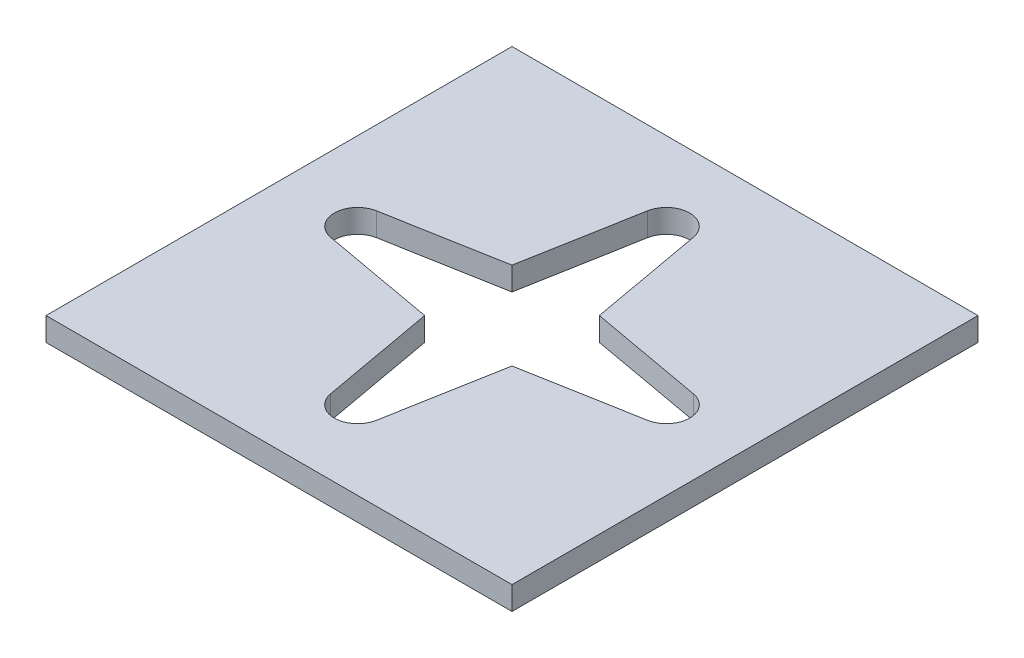
ISO-10303-21;
HEADER;
FILE_DESCRIPTION(('STEP AP214'),'2;1');
FILE_NAME('part.step','',(''),(''),'','','');
FILE_SCHEMA(('AUTOMOTIVE_DESIGN { 1 0 10303 214 1 1 1 1 }'));
ENDSEC;
DATA;
#1=APPLICATION_CONTEXT('core data for automotive mechanical design processes');
#2=APPLICATION_PROTOCOL_DEFINITION('international standard','automotive_design',2000,#1);
#3=PRODUCT_CONTEXT('',#1,'mechanical');
#4=PRODUCT('Part','Part','',(#3));
#5=PRODUCT_RELATED_PRODUCT_CATEGORY('part','',(#4));
#6=PRODUCT_DEFINITION_FORMATION('','',#4);
#7=PRODUCT_DEFINITION_CONTEXT('part definition',#1,'design');
#8=PRODUCT_DEFINITION('design','',#6,#7);
#9=PRODUCT_DEFINITION_SHAPE('','',#8);
#10=(LENGTH_UNIT() NAMED_UNIT(*) SI_UNIT(.MILLI.,.METRE.));
#11=(NAMED_UNIT(*) PLANE_ANGLE_UNIT() SI_UNIT($,.RADIAN.));
#12=(NAMED_UNIT(*) SI_UNIT($,.STERADIAN.) SOLID_ANGLE_UNIT());
#13=UNCERTAINTY_MEASURE_WITH_UNIT(LENGTH_MEASURE(1.E-05),#10,'distance_accuracy_value','');
#14=(GEOMETRIC_REPRESENTATION_CONTEXT(3) GLOBAL_UNCERTAINTY_ASSIGNED_CONTEXT((#13)) GLOBAL_UNIT_ASSIGNED_CONTEXT((#10,
#11,#12)) REPRESENTATION_CONTEXT('',''));
#15=CARTESIAN_POINT('',(0.,0.,0.));
#16=DIRECTION('',(0.,0.,1.));
#17=DIRECTION('',(1.,0.,0.));
#18=AXIS2_PLACEMENT_3D('',#15,#16,#17);
#19=CARTESIAN_POINT('',(25.4,2.54,-25.4));
#20=DIRECTION('',(-1.,0.,0.));
#21=DIRECTION('',(0.,0.,1.));
#22=AXIS2_PLACEMENT_3D('',#19,#20,#21);
#23=PLANE('',#22);
#24=DIRECTION('',(0.,0.,-1.));
#25=VECTOR('',#24,1.);
#26=CARTESIAN_POINT('',(25.4,0.,-25.4));
#27=LINE('',#26,#25);
#28=CARTESIAN_POINT('',(25.4,0.,25.4));
#29=VERTEX_POINT('',#28);
#30=CARTESIAN_POINT('',(25.4,0.,-25.4));
#31=VERTEX_POINT('',#30);
#32=EDGE_CURVE('E219',#29,#31,#27,.T.);
#33=ORIENTED_EDGE('',*,*,#32,.T.);
#34=DIRECTION('',(0.,-1.,0.));
#35=VECTOR('',#34,1.);
#36=CARTESIAN_POINT('',(25.4,2.54,-25.4));
#37=LINE('',#36,#35);
#38=CARTESIAN_POINT('',(25.4,2.54,-25.4));
#39=VERTEX_POINT('',#38);
#40=EDGE_CURVE('E11',#39,#31,#37,.T.);
#41=ORIENTED_EDGE('',*,*,#40,.F.);
#42=DIRECTION('',(0.,0.,-1.));
#43=VECTOR('',#42,1.);
#44=CARTESIAN_POINT('',(25.4,2.54,-25.4));
#45=LINE('',#44,#43);
#46=CARTESIAN_POINT('',(25.4,2.54,25.4));
#47=VERTEX_POINT('',#46);
#48=EDGE_CURVE('E239',#47,#39,#45,.T.);
#49=ORIENTED_EDGE('',*,*,#48,.F.);
#50=DIRECTION('',(0.,-1.,0.));
#51=VECTOR('',#50,1.);
#52=CARTESIAN_POINT('',(25.4,2.54,25.4));
#53=LINE('',#52,#51);
#54=EDGE_CURVE('E249',#47,#29,#53,.T.);
#55=ORIENTED_EDGE('',*,*,#54,.T.);
#56=EDGE_LOOP('',(#33,#41,#49,#55));
#57=FACE_BOUND('',#56,.T.);
#58=ADVANCED_FACE('F32',(#57),#23,.F.);
#59=CARTESIAN_POINT('',(-25.4,2.54,-25.4));
#60=DIRECTION('',(0.,0.,1.));
#61=DIRECTION('',(1.,0.,0.));
#62=AXIS2_PLACEMENT_3D('',#59,#60,#61);
#63=PLANE('',#62);
#64=DIRECTION('',(-1.,0.,0.));
#65=VECTOR('',#64,1.);
#66=CARTESIAN_POINT('',(-25.4,0.,-25.4));
#67=LINE('',#66,#65);
#68=CARTESIAN_POINT('',(-25.4,0.,-25.4));
#69=VERTEX_POINT('',#68);
#70=EDGE_CURVE('E252',#31,#69,#67,.T.);
#71=ORIENTED_EDGE('',*,*,#70,.T.);
#72=DIRECTION('',(0.,-1.,0.));
#73=VECTOR('',#72,1.);
#74=CARTESIAN_POINT('',(-25.4,2.54,-25.4));
#75=LINE('',#74,#73);
#76=CARTESIAN_POINT('',(-25.4,2.54,-25.4));
#77=VERTEX_POINT('',#76);
#78=EDGE_CURVE('E39',#77,#69,#75,.T.);
#79=ORIENTED_EDGE('',*,*,#78,.F.);
#80=DIRECTION('',(-1.,0.,0.));
#81=VECTOR('',#80,1.);
#82=CARTESIAN_POINT('',(-25.4,2.54,-25.4));
#83=LINE('',#82,#81);
#84=EDGE_CURVE('E242',#39,#77,#83,.T.);
#85=ORIENTED_EDGE('',*,*,#84,.F.);
#86=ORIENTED_EDGE('',*,*,#40,.T.);
#87=EDGE_LOOP('',(#71,#79,#85,#86));
#88=FACE_BOUND('',#87,.T.);
#89=ADVANCED_FACE('F280',(#88),#63,.F.);
#90=CARTESIAN_POINT('',(-25.4,2.54,-25.4));
#91=DIRECTION('',(1.,0.,0.));
#92=DIRECTION('',(0.,0.,-1.));
#93=AXIS2_PLACEMENT_3D('',#90,#91,#92);
#94=PLANE('',#93);
#95=DIRECTION('',(0.,0.,1.));
#96=VECTOR('',#95,1.);
#97=CARTESIAN_POINT('',(-25.4,0.,-25.4));
#98=LINE('',#97,#96);
#99=CARTESIAN_POINT('',(-25.4,0.,25.4));
#100=VERTEX_POINT('',#99);
#101=EDGE_CURVE('E254',#69,#100,#98,.T.);
#102=ORIENTED_EDGE('',*,*,#101,.T.);
#103=DIRECTION('',(0.,-1.,0.));
#104=VECTOR('',#103,1.);
#105=CARTESIAN_POINT('',(-25.4,2.54,25.4));
#106=LINE('',#105,#104);
#107=CARTESIAN_POINT('',(-25.4,2.54,25.4));
#108=VERTEX_POINT('',#107);
#109=EDGE_CURVE('E259',#108,#100,#106,.T.);
#110=ORIENTED_EDGE('',*,*,#109,.F.);
#111=DIRECTION('',(0.,0.,1.));
#112=VECTOR('',#111,1.);
#113=CARTESIAN_POINT('',(-25.4,2.54,-25.4));
#114=LINE('',#113,#112);
#115=EDGE_CURVE('E245',#77,#108,#114,.T.);
#116=ORIENTED_EDGE('',*,*,#115,.F.);
#117=ORIENTED_EDGE('',*,*,#78,.T.);
#118=EDGE_LOOP('',(#102,#110,#116,#117));
#119=FACE_BOUND('',#118,.T.);
#120=ADVANCED_FACE('F266',(#119),#94,.F.);
#121=CARTESIAN_POINT('',(-25.4,2.54,25.4));
#122=DIRECTION('',(0.,0.,-1.));
#123=DIRECTION('',(-1.,0.,0.));
#124=AXIS2_PLACEMENT_3D('',#121,#122,#123);
#125=PLANE('',#124);
#126=DIRECTION('',(1.,0.,0.));
#127=VECTOR('',#126,1.);
#128=CARTESIAN_POINT('',(-25.4,0.,25.4));
#129=LINE('',#128,#127);
#130=EDGE_CURVE('E243',#100,#29,#129,.T.);
#131=ORIENTED_EDGE('',*,*,#130,.T.);
#132=ORIENTED_EDGE('',*,*,#54,.F.);
#133=DIRECTION('',(1.,0.,0.));
#134=VECTOR('',#133,1.);
#135=CARTESIAN_POINT('',(-25.4,2.54,25.4));
#136=LINE('',#135,#134);
#137=EDGE_CURVE('E247',#108,#47,#136,.T.);
#138=ORIENTED_EDGE('',*,*,#137,.F.);
#139=ORIENTED_EDGE('',*,*,#109,.T.);
#140=EDGE_LOOP('',(#131,#132,#138,#139));
#141=FACE_BOUND('',#140,.T.);
#142=ADVANCED_FACE('F275',(#141),#125,.F.);
#143=CARTESIAN_POINT('',(0.,2.54,0.));
#144=DIRECTION('',(0.,1.,0.));
#145=DIRECTION('',(0.,0.,1.));
#146=AXIS2_PLACEMENT_3D('',#143,#144,#145);
#147=PLANE('',#146);
#148=DIRECTION('',(-0.98409435617326,0.,-0.177646553999611));
#149=VECTOR('',#148,1.);
#150=CARTESIAN_POINT('',(-4.75953574416668,2.54,4.75953574416663));
#151=LINE('',#150,#149);
#152=CARTESIAN_POINT('',(-4.75953574416668,2.54,4.75953574416663));
#153=VERTEX_POINT('',#152);
#154=CARTESIAN_POINT('',(-17.278722247159,2.54,2.49959966468008));
#155=VERTEX_POINT('',#154);
#156=EDGE_CURVE('E146',#153,#155,#151,.T.);
#157=ORIENTED_EDGE('',*,*,#156,.T.);
#158=CARTESIAN_POINT('',(-16.8275,2.54,0.));
#159=DIRECTION('',(0.,-1.,0.));
#160=DIRECTION('',(0.,0.,-1.));
#161=AXIS2_PLACEMENT_3D('',#158,#159,#160);
#162=CIRCLE('',#161,2.54);
#163=CARTESIAN_POINT('',(-17.278722247159,2.54,-2.49959966468008));
#164=VERTEX_POINT('',#163);
#165=EDGE_CURVE('E152',#155,#164,#162,.T.);
#166=ORIENTED_EDGE('',*,*,#165,.T.);
#167=DIRECTION('',(-0.98409435617326,0.,0.177646553999611));
#168=VECTOR('',#167,1.);
#169=CARTESIAN_POINT('',(-4.75953574416668,2.54,-4.75953574416663));
#170=LINE('',#169,#168);
#171=CARTESIAN_POINT('',(-4.75953574416668,2.54,-4.75953574416663));
#172=VERTEX_POINT('',#171);
#173=EDGE_CURVE('E156',#172,#164,#170,.T.);
#174=ORIENTED_EDGE('',*,*,#173,.F.);
#175=DIRECTION('',(0.177646553999614,0.,-0.98409435617326));
#176=VECTOR('',#175,1.);
#177=CARTESIAN_POINT('',(-4.75953574416668,2.54,-4.75953574416663));
#178=LINE('',#177,#176);
#179=CARTESIAN_POINT('',(-2.49959966468009,2.54,-17.278722247159));
#180=VERTEX_POINT('',#179);
#181=EDGE_CURVE('E168',#172,#180,#178,.T.);
#182=ORIENTED_EDGE('',*,*,#181,.T.);
#183=CARTESIAN_POINT('',(0.,2.54,-16.8275));
#184=DIRECTION('',(0.,1.,0.));
#185=DIRECTION('',(0.,0.,1.));
#186=AXIS2_PLACEMENT_3D('',#183,#184,#185);
#187=CIRCLE('',#186,2.54);
#188=CARTESIAN_POINT('',(2.49959966468008,2.54,-17.278722247159));
#189=VERTEX_POINT('',#188);
#190=EDGE_CURVE('E171',#189,#180,#187,.T.);
#191=ORIENTED_EDGE('',*,*,#190,.F.);
#192=DIRECTION('',(-0.177646553999614,0.,-0.98409435617326));
#193=VECTOR('',#192,1.);
#194=CARTESIAN_POINT('',(4.75953574416668,2.54,-4.75953574416664));
#195=LINE('',#194,#193);
#196=CARTESIAN_POINT('',(4.75953574416668,2.54,-4.75953574416664));
#197=VERTEX_POINT('',#196);
#198=EDGE_CURVE('E173',#197,#189,#195,.T.);
#199=ORIENTED_EDGE('',*,*,#198,.F.);
#200=DIRECTION('',(0.98409435617326,0.,0.177646553999611));
#201=VECTOR('',#200,1.);
#202=CARTESIAN_POINT('',(4.75953574416668,2.54,-4.75953574416664));
#203=LINE('',#202,#201);
#204=CARTESIAN_POINT('',(17.278722247159,2.54,-2.49959966468008));
#205=VERTEX_POINT('',#204);
#206=EDGE_CURVE('E175',#197,#205,#203,.T.);
#207=ORIENTED_EDGE('',*,*,#206,.T.);
#208=CARTESIAN_POINT('',(16.8275,2.54,0.));
#209=DIRECTION('',(0.,1.,0.));
#210=DIRECTION('',(0.,0.,1.));
#211=AXIS2_PLACEMENT_3D('',#208,#209,#210);
#212=CIRCLE('',#211,2.54000000000001);
#213=CARTESIAN_POINT('',(17.278722247159,2.54,2.49959966468009));
#214=VERTEX_POINT('',#213);
#215=EDGE_CURVE('E178',#214,#205,#212,.T.);
#216=ORIENTED_EDGE('',*,*,#215,.F.);
#217=DIRECTION('',(0.98409435617326,0.,-0.177646553999611));
#218=VECTOR('',#217,1.);
#219=CARTESIAN_POINT('',(4.75953574416668,2.54,4.75953574416664));
#220=LINE('',#219,#218);
#221=CARTESIAN_POINT('',(4.75953574416668,2.54,4.75953574416664));
#222=VERTEX_POINT('',#221);
#223=EDGE_CURVE('E180',#222,#214,#220,.T.);
#224=ORIENTED_EDGE('',*,*,#223,.F.);
#225=DIRECTION('',(-0.177646553999614,0.,0.98409435617326));
#226=VECTOR('',#225,1.);
#227=CARTESIAN_POINT('',(4.75953574416668,2.54,4.75953574416664));
#228=LINE('',#227,#226);
#229=CARTESIAN_POINT('',(2.49959966468008,2.54,17.278722247159));
#230=VERTEX_POINT('',#229);
#231=EDGE_CURVE('E182',#222,#230,#228,.T.);
#232=ORIENTED_EDGE('',*,*,#231,.T.);
#233=CARTESIAN_POINT('',(0.,2.54,16.8275));
#234=DIRECTION('',(0.,-1.,0.));
#235=DIRECTION('',(0.,0.,-1.));
#236=AXIS2_PLACEMENT_3D('',#233,#234,#235);
#237=CIRCLE('',#236,2.54000000000001);
#238=CARTESIAN_POINT('',(-2.49959966468009,2.54,17.278722247159));
#239=VERTEX_POINT('',#238);
#240=EDGE_CURVE('E185',#230,#239,#237,.T.);
#241=ORIENTED_EDGE('',*,*,#240,.T.);
#242=DIRECTION('',(0.177646553999614,0.,0.98409435617326));
#243=VECTOR('',#242,1.);
#244=CARTESIAN_POINT('',(-4.75953574416668,2.54,4.75953574416663));
#245=LINE('',#244,#243);
#246=EDGE_CURVE('E149',#153,#239,#245,.T.);
#247=ORIENTED_EDGE('',*,*,#246,.F.);
#248=EDGE_LOOP('',(#157,#166,#174,#182,#191,#199,#207,#216,#224,#232,#241,#247));
#249=FACE_BOUND('',#248,.T.);
#250=ORIENTED_EDGE('',*,*,#48,.T.);
#251=ORIENTED_EDGE('',*,*,#84,.T.);
#252=ORIENTED_EDGE('',*,*,#115,.T.);
#253=ORIENTED_EDGE('',*,*,#137,.T.);
#254=EDGE_LOOP('',(#250,#251,#252,#253));
#255=FACE_BOUND('',#254,.T.);
#256=ADVANCED_FACE('F158',(#249,#255),#147,.T.);
#257=CARTESIAN_POINT('',(0.,0.,0.));
#258=DIRECTION('',(0.,1.,0.));
#259=DIRECTION('',(0.,0.,1.));
#260=AXIS2_PLACEMENT_3D('',#257,#258,#259);
#261=PLANE('',#260);
#262=CARTESIAN_POINT('',(-16.8275,0.,0.));
#263=DIRECTION('',(0.,-1.,0.));
#264=DIRECTION('',(0.,0.,-1.));
#265=AXIS2_PLACEMENT_3D('',#262,#263,#264);
#266=CIRCLE('',#265,2.54);
#267=CARTESIAN_POINT('',(-17.278722247159,0.,2.49959966468008));
#268=VERTEX_POINT('',#267);
#269=CARTESIAN_POINT('',(-17.278722247159,0.,-2.49959966468008));
#270=VERTEX_POINT('',#269);
#271=EDGE_CURVE('E189',#268,#270,#266,.T.);
#272=ORIENTED_EDGE('',*,*,#271,.F.);
#273=DIRECTION('',(-0.98409435617326,0.,-0.177646553999611));
#274=VECTOR('',#273,1.);
#275=CARTESIAN_POINT('',(-4.75953574416668,0.,4.75953574416663));
#276=LINE('',#275,#274);
#277=CARTESIAN_POINT('',(-4.75953574416668,0.,4.75953574416663));
#278=VERTEX_POINT('',#277);
#279=EDGE_CURVE('E54',#278,#268,#276,.T.);
#280=ORIENTED_EDGE('',*,*,#279,.F.);
#281=DIRECTION('',(0.177646553999614,0.,0.98409435617326));
#282=VECTOR('',#281,1.);
#283=CARTESIAN_POINT('',(-4.75953574416668,0.,4.75953574416663));
#284=LINE('',#283,#282);
#285=CARTESIAN_POINT('',(-2.49959966468009,0.,17.278722247159));
#286=VERTEX_POINT('',#285);
#287=EDGE_CURVE('E161',#278,#286,#284,.T.);
#288=ORIENTED_EDGE('',*,*,#287,.T.);
#289=CARTESIAN_POINT('',(0.,0.,16.8275));
#290=DIRECTION('',(0.,-1.,0.));
#291=DIRECTION('',(0.,0.,-1.));
#292=AXIS2_PLACEMENT_3D('',#289,#290,#291);
#293=CIRCLE('',#292,2.54000000000001);
#294=CARTESIAN_POINT('',(2.49959966468008,0.,17.278722247159));
#295=VERTEX_POINT('',#294);
#296=EDGE_CURVE('E164',#295,#286,#293,.T.);
#297=ORIENTED_EDGE('',*,*,#296,.F.);
#298=DIRECTION('',(-0.177646553999614,0.,0.98409435617326));
#299=VECTOR('',#298,1.);
#300=CARTESIAN_POINT('',(4.75953574416668,0.,4.75953574416664));
#301=LINE('',#300,#299);
#302=CARTESIAN_POINT('',(4.75953574416668,0.,4.75953574416664));
#303=VERTEX_POINT('',#302);
#304=EDGE_CURVE('E212',#303,#295,#301,.T.);
#305=ORIENTED_EDGE('',*,*,#304,.F.);
#306=DIRECTION('',(0.98409435617326,0.,-0.177646553999611));
#307=VECTOR('',#306,1.);
#308=CARTESIAN_POINT('',(4.75953574416668,0.,4.75953574416664));
#309=LINE('',#308,#307);
#310=CARTESIAN_POINT('',(17.278722247159,0.,2.49959966468009));
#311=VERTEX_POINT('',#310);
#312=EDGE_CURVE('E209',#303,#311,#309,.T.);
#313=ORIENTED_EDGE('',*,*,#312,.T.);
#314=CARTESIAN_POINT('',(16.8275,0.,0.));
#315=DIRECTION('',(0.,1.,0.));
#316=DIRECTION('',(0.,0.,1.));
#317=AXIS2_PLACEMENT_3D('',#314,#315,#316);
#318=CIRCLE('',#317,2.54000000000001);
#319=CARTESIAN_POINT('',(17.278722247159,0.,-2.49959966468008));
#320=VERTEX_POINT('',#319);
#321=EDGE_CURVE('E206',#311,#320,#318,.T.);
#322=ORIENTED_EDGE('',*,*,#321,.T.);
#323=DIRECTION('',(0.98409435617326,0.,0.177646553999611));
#324=VECTOR('',#323,1.);
#325=CARTESIAN_POINT('',(4.75953574416668,0.,-4.75953574416664));
#326=LINE('',#325,#324);
#327=CARTESIAN_POINT('',(4.75953574416668,0.,-4.75953574416664));
#328=VERTEX_POINT('',#327);
#329=EDGE_CURVE('E203',#328,#320,#326,.T.);
#330=ORIENTED_EDGE('',*,*,#329,.F.);
#331=DIRECTION('',(-0.177646553999614,0.,-0.98409435617326));
#332=VECTOR('',#331,1.);
#333=CARTESIAN_POINT('',(4.75953574416668,0.,-4.75953574416664));
#334=LINE('',#333,#332);
#335=CARTESIAN_POINT('',(2.49959966468008,0.,-17.278722247159));
#336=VERTEX_POINT('',#335);
#337=EDGE_CURVE('E200',#328,#336,#334,.T.);
#338=ORIENTED_EDGE('',*,*,#337,.T.);
#339=CARTESIAN_POINT('',(0.,0.,-16.8275));
#340=DIRECTION('',(0.,1.,0.));
#341=DIRECTION('',(0.,0.,1.));
#342=AXIS2_PLACEMENT_3D('',#339,#340,#341);
#343=CIRCLE('',#342,2.54);
#344=CARTESIAN_POINT('',(-2.49959966468009,0.,-17.278722247159));
#345=VERTEX_POINT('',#344);
#346=EDGE_CURVE('E197',#336,#345,#343,.T.);
#347=ORIENTED_EDGE('',*,*,#346,.T.);
#348=DIRECTION('',(0.177646553999614,0.,-0.98409435617326));
#349=VECTOR('',#348,1.);
#350=CARTESIAN_POINT('',(-4.75953574416668,0.,-4.75953574416663));
#351=LINE('',#350,#349);
#352=CARTESIAN_POINT('',(-4.75953574416668,0.,-4.75953574416663));
#353=VERTEX_POINT('',#352);
#354=EDGE_CURVE('E194',#353,#345,#351,.T.);
#355=ORIENTED_EDGE('',*,*,#354,.F.);
#356=DIRECTION('',(-0.98409435617326,0.,0.177646553999611));
#357=VECTOR('',#356,1.);
#358=CARTESIAN_POINT('',(-4.75953574416668,0.,-4.75953574416663));
#359=LINE('',#358,#357);
#360=EDGE_CURVE('E191',#353,#270,#359,.T.);
#361=ORIENTED_EDGE('',*,*,#360,.T.);
#362=EDGE_LOOP('',(#272,#280,#288,#297,#305,#313,#322,#330,#338,#347,#355,#361));
#363=FACE_BOUND('',#362,.T.);
#364=ORIENTED_EDGE('',*,*,#32,.F.);
#365=ORIENTED_EDGE('',*,*,#130,.F.);
#366=ORIENTED_EDGE('',*,*,#101,.F.);
#367=ORIENTED_EDGE('',*,*,#70,.F.);
#368=EDGE_LOOP('',(#364,#365,#366,#367));
#369=FACE_BOUND('',#368,.T.);
#370=ADVANCED_FACE('F272',(#363,#369),#261,.F.);
#371=CARTESIAN_POINT('',(-4.75953574416668,2.54,4.75953574416663));
#372=DIRECTION('',(-0.177646553999611,0.,0.98409435617326));
#373=DIRECTION('',(0.98409435617326,0.,0.177646553999611));
#374=AXIS2_PLACEMENT_3D('',#371,#372,#373);
#375=PLANE('',#374);
#376=ORIENTED_EDGE('',*,*,#279,.T.);
#377=DIRECTION('',(0.,-1.,0.));
#378=VECTOR('',#377,1.);
#379=CARTESIAN_POINT('',(-17.278722247159,2.54,2.49959966468008));
#380=LINE('',#379,#378);
#381=EDGE_CURVE('E143',#155,#268,#380,.T.);
#382=ORIENTED_EDGE('',*,*,#381,.F.);
#383=ORIENTED_EDGE('',*,*,#156,.F.);
#384=DIRECTION('',(0.,-1.,0.));
#385=VECTOR('',#384,1.);
#386=CARTESIAN_POINT('',(-4.75953574416668,2.54,4.75953574416663));
#387=LINE('',#386,#385);
#388=EDGE_CURVE('E217',#153,#278,#387,.T.);
#389=ORIENTED_EDGE('',*,*,#388,.T.);
#390=EDGE_LOOP('',(#376,#382,#383,#389));
#391=FACE_BOUND('',#390,.T.);
#392=ADVANCED_FACE('F144',(#391),#375,.F.);
#393=CARTESIAN_POINT('',(-4.75953574416668,2.54,4.75953574416663));
#394=DIRECTION('',(0.98409435617326,0.,-0.177646553999614));
#395=DIRECTION('',(-0.177646553999614,0.,-0.98409435617326));
#396=AXIS2_PLACEMENT_3D('',#393,#394,#395);
#397=PLANE('',#396);
#398=ORIENTED_EDGE('',*,*,#287,.F.);
#399=ORIENTED_EDGE('',*,*,#388,.F.);
#400=ORIENTED_EDGE('',*,*,#246,.T.);
#401=DIRECTION('',(0.,-1.,0.));
#402=VECTOR('',#401,1.);
#403=CARTESIAN_POINT('',(-2.49959966468009,2.54,17.278722247159));
#404=LINE('',#403,#402);
#405=EDGE_CURVE('E220',#239,#286,#404,.T.);
#406=ORIENTED_EDGE('',*,*,#405,.T.);
#407=EDGE_LOOP('',(#398,#399,#400,#406));
#408=FACE_BOUND('',#407,.T.);
#409=ADVANCED_FACE('F297',(#408),#397,.T.);
#410=CARTESIAN_POINT('',(0.,2.54,16.8275));
#411=DIRECTION('',(0.,-1.,0.));
#412=DIRECTION('',(0.,0.,-1.));
#413=AXIS2_PLACEMENT_3D('',#410,#411,#412);
#414=CYLINDRICAL_SURFACE('',#413,2.54000000000001);
#415=ORIENTED_EDGE('',*,*,#296,.T.);
#416=ORIENTED_EDGE('',*,*,#405,.F.);
#417=ORIENTED_EDGE('',*,*,#240,.F.);
#418=DIRECTION('',(0.,-1.,0.));
#419=VECTOR('',#418,1.);
#420=CARTESIAN_POINT('',(2.49959966468008,2.54,17.278722247159));
#421=LINE('',#420,#419);
#422=EDGE_CURVE('E222',#230,#295,#421,.T.);
#423=ORIENTED_EDGE('',*,*,#422,.T.);
#424=EDGE_LOOP('',(#415,#416,#417,#423));
#425=FACE_BOUND('',#424,.T.);
#426=ADVANCED_FACE('F331',(#425),#414,.F.);
#427=CARTESIAN_POINT('',(4.75953574416668,2.54,4.75953574416664));
#428=DIRECTION('',(0.98409435617326,0.,0.177646553999614));
#429=DIRECTION('',(0.177646553999614,0.,-0.98409435617326));
#430=AXIS2_PLACEMENT_3D('',#427,#428,#429);
#431=PLANE('',#430);
#432=ORIENTED_EDGE('',*,*,#304,.T.);
#433=ORIENTED_EDGE('',*,*,#422,.F.);
#434=ORIENTED_EDGE('',*,*,#231,.F.);
#435=DIRECTION('',(0.,-1.,0.));
#436=VECTOR('',#435,1.);
#437=CARTESIAN_POINT('',(4.75953574416668,2.54,4.75953574416664));
#438=LINE('',#437,#436);
#439=EDGE_CURVE('E224',#222,#303,#438,.T.);
#440=ORIENTED_EDGE('',*,*,#439,.T.);
#441=EDGE_LOOP('',(#432,#433,#434,#440));
#442=FACE_BOUND('',#441,.T.);
#443=ADVANCED_FACE('F327',(#442),#431,.F.);
#444=CARTESIAN_POINT('',(4.75953574416668,2.54,4.75953574416664));
#445=DIRECTION('',(-0.177646553999611,0.,-0.98409435617326));
#446=DIRECTION('',(-0.98409435617326,0.,0.177646553999611));
#447=AXIS2_PLACEMENT_3D('',#444,#445,#446);
#448=PLANE('',#447);
#449=ORIENTED_EDGE('',*,*,#312,.F.);
#450=ORIENTED_EDGE('',*,*,#439,.F.);
#451=ORIENTED_EDGE('',*,*,#223,.T.);
#452=DIRECTION('',(0.,-1.,0.));
#453=VECTOR('',#452,1.);
#454=CARTESIAN_POINT('',(17.278722247159,2.54,2.49959966468009));
#455=LINE('',#454,#453);
#456=EDGE_CURVE('E226',#214,#311,#455,.T.);
#457=ORIENTED_EDGE('',*,*,#456,.T.);
#458=EDGE_LOOP('',(#449,#450,#451,#457));
#459=FACE_BOUND('',#458,.T.);
#460=ADVANCED_FACE('F323',(#459),#448,.T.);
#461=CARTESIAN_POINT('',(16.8275,2.54,0.));
#462=DIRECTION('',(0.,-1.,0.));
#463=DIRECTION('',(0.,0.,-1.));
#464=AXIS2_PLACEMENT_3D('',#461,#462,#463);
#465=CYLINDRICAL_SURFACE('',#464,2.54000000000001);
#466=ORIENTED_EDGE('',*,*,#321,.F.);
#467=ORIENTED_EDGE('',*,*,#456,.F.);
#468=ORIENTED_EDGE('',*,*,#215,.T.);
#469=DIRECTION('',(0.,-1.,0.));
#470=VECTOR('',#469,1.);
#471=CARTESIAN_POINT('',(17.278722247159,2.54,-2.49959966468008));
#472=LINE('',#471,#470);
#473=EDGE_CURVE('E228',#205,#320,#472,.T.);
#474=ORIENTED_EDGE('',*,*,#473,.T.);
#475=EDGE_LOOP('',(#466,#467,#468,#474));
#476=FACE_BOUND('',#475,.T.);
#477=ADVANCED_FACE('F319',(#476),#465,.F.);
#478=CARTESIAN_POINT('',(4.75953574416668,2.54,-4.75953574416664));
#479=DIRECTION('',(0.177646553999611,0.,-0.98409435617326));
#480=DIRECTION('',(-0.98409435617326,0.,-0.177646553999611));
#481=AXIS2_PLACEMENT_3D('',#478,#479,#480);
#482=PLANE('',#481);
#483=ORIENTED_EDGE('',*,*,#329,.T.);
#484=ORIENTED_EDGE('',*,*,#473,.F.);
#485=ORIENTED_EDGE('',*,*,#206,.F.);
#486=DIRECTION('',(0.,-1.,0.));
#487=VECTOR('',#486,1.);
#488=CARTESIAN_POINT('',(4.75953574416668,2.54,-4.75953574416664));
#489=LINE('',#488,#487);
#490=EDGE_CURVE('E230',#197,#328,#489,.T.);
#491=ORIENTED_EDGE('',*,*,#490,.T.);
#492=EDGE_LOOP('',(#483,#484,#485,#491));
#493=FACE_BOUND('',#492,.T.);
#494=ADVANCED_FACE('F315',(#493),#482,.F.);
#495=CARTESIAN_POINT('',(4.75953574416668,2.54,-4.75953574416664));
#496=DIRECTION('',(-0.98409435617326,0.,0.177646553999614));
#497=DIRECTION('',(0.177646553999614,0.,0.98409435617326));
#498=AXIS2_PLACEMENT_3D('',#495,#496,#497);
#499=PLANE('',#498);
#500=ORIENTED_EDGE('',*,*,#337,.F.);
#501=ORIENTED_EDGE('',*,*,#490,.F.);
#502=ORIENTED_EDGE('',*,*,#198,.T.);
#503=DIRECTION('',(0.,-1.,0.));
#504=VECTOR('',#503,1.);
#505=CARTESIAN_POINT('',(2.49959966468008,2.54,-17.278722247159));
#506=LINE('',#505,#504);
#507=EDGE_CURVE('E232',#189,#336,#506,.T.);
#508=ORIENTED_EDGE('',*,*,#507,.T.);
#509=EDGE_LOOP('',(#500,#501,#502,#508));
#510=FACE_BOUND('',#509,.T.);
#511=ADVANCED_FACE('F311',(#510),#499,.T.);
#512=CARTESIAN_POINT('',(0.,2.54,-16.8275));
#513=DIRECTION('',(0.,-1.,0.));
#514=DIRECTION('',(0.,0.,-1.));
#515=AXIS2_PLACEMENT_3D('',#512,#513,#514);
#516=CYLINDRICAL_SURFACE('',#515,2.54);
#517=ORIENTED_EDGE('',*,*,#346,.F.);
#518=ORIENTED_EDGE('',*,*,#507,.F.);
#519=ORIENTED_EDGE('',*,*,#190,.T.);
#520=DIRECTION('',(0.,-1.,0.));
#521=VECTOR('',#520,1.);
#522=CARTESIAN_POINT('',(-2.49959966468009,2.54,-17.278722247159));
#523=LINE('',#522,#521);
#524=EDGE_CURVE('E234',#180,#345,#523,.T.);
#525=ORIENTED_EDGE('',*,*,#524,.T.);
#526=EDGE_LOOP('',(#517,#518,#519,#525));
#527=FACE_BOUND('',#526,.T.);
#528=ADVANCED_FACE('F307',(#527),#516,.F.);
#529=CARTESIAN_POINT('',(-4.75953574416668,2.54,-4.75953574416663));
#530=DIRECTION('',(-0.98409435617326,0.,-0.177646553999614));
#531=DIRECTION('',(-0.177646553999614,0.,0.98409435617326));
#532=AXIS2_PLACEMENT_3D('',#529,#530,#531);
#533=PLANE('',#532);
#534=ORIENTED_EDGE('',*,*,#354,.T.);
#535=ORIENTED_EDGE('',*,*,#524,.F.);
#536=ORIENTED_EDGE('',*,*,#181,.F.);
#537=DIRECTION('',(0.,-1.,0.));
#538=VECTOR('',#537,1.);
#539=CARTESIAN_POINT('',(-4.75953574416668,2.54,-4.75953574416663));
#540=LINE('',#539,#538);
#541=EDGE_CURVE('E236',#172,#353,#540,.T.);
#542=ORIENTED_EDGE('',*,*,#541,.T.);
#543=EDGE_LOOP('',(#534,#535,#536,#542));
#544=FACE_BOUND('',#543,.T.);
#545=ADVANCED_FACE('F303',(#544),#533,.F.);
#546=CARTESIAN_POINT('',(-4.75953574416668,2.54,-4.75953574416663));
#547=DIRECTION('',(0.177646553999611,0.,0.98409435617326));
#548=DIRECTION('',(0.98409435617326,0.,-0.177646553999611));
#549=AXIS2_PLACEMENT_3D('',#546,#547,#548);
#550=PLANE('',#549);
#551=ORIENTED_EDGE('',*,*,#360,.F.);
#552=ORIENTED_EDGE('',*,*,#541,.F.);
#553=ORIENTED_EDGE('',*,*,#173,.T.);
#554=DIRECTION('',(0.,-1.,0.));
#555=VECTOR('',#554,1.);
#556=CARTESIAN_POINT('',(-17.278722247159,2.54,-2.49959966468008));
#557=LINE('',#556,#555);
#558=EDGE_CURVE('E46',#164,#270,#557,.T.);
#559=ORIENTED_EDGE('',*,*,#558,.T.);
#560=EDGE_LOOP('',(#551,#552,#553,#559));
#561=FACE_BOUND('',#560,.T.);
#562=ADVANCED_FACE('F300',(#561),#550,.T.);
#563=CARTESIAN_POINT('',(-16.8275,2.54,0.));
#564=DIRECTION('',(0.,-1.,0.));
#565=DIRECTION('',(0.,0.,-1.));
#566=AXIS2_PLACEMENT_3D('',#563,#564,#565);
#567=CYLINDRICAL_SURFACE('',#566,2.54);
#568=ORIENTED_EDGE('',*,*,#271,.T.);
#569=ORIENTED_EDGE('',*,*,#558,.F.);
#570=ORIENTED_EDGE('',*,*,#165,.F.);
#571=ORIENTED_EDGE('',*,*,#381,.T.);
#572=EDGE_LOOP('',(#568,#569,#570,#571));
#573=FACE_BOUND('',#572,.T.);
#574=ADVANCED_FACE('F153',(#573),#567,.F.);
#575=CLOSED_SHELL('',(#58,#89,#120,#142,#256,#370,#392,#409,#426,#443,#460,#477,#494,#511,#528,
#545,#562,#574));
#576=MANIFOLD_SOLID_BREP('B2',#575);
#577=ADVANCED_BREP_SHAPE_REPRESENTATION('',(#18,#576),#14);
#578=SHAPE_DEFINITION_REPRESENTATION(#9,#577);
ENDSEC;
END-ISO-10303-21;
